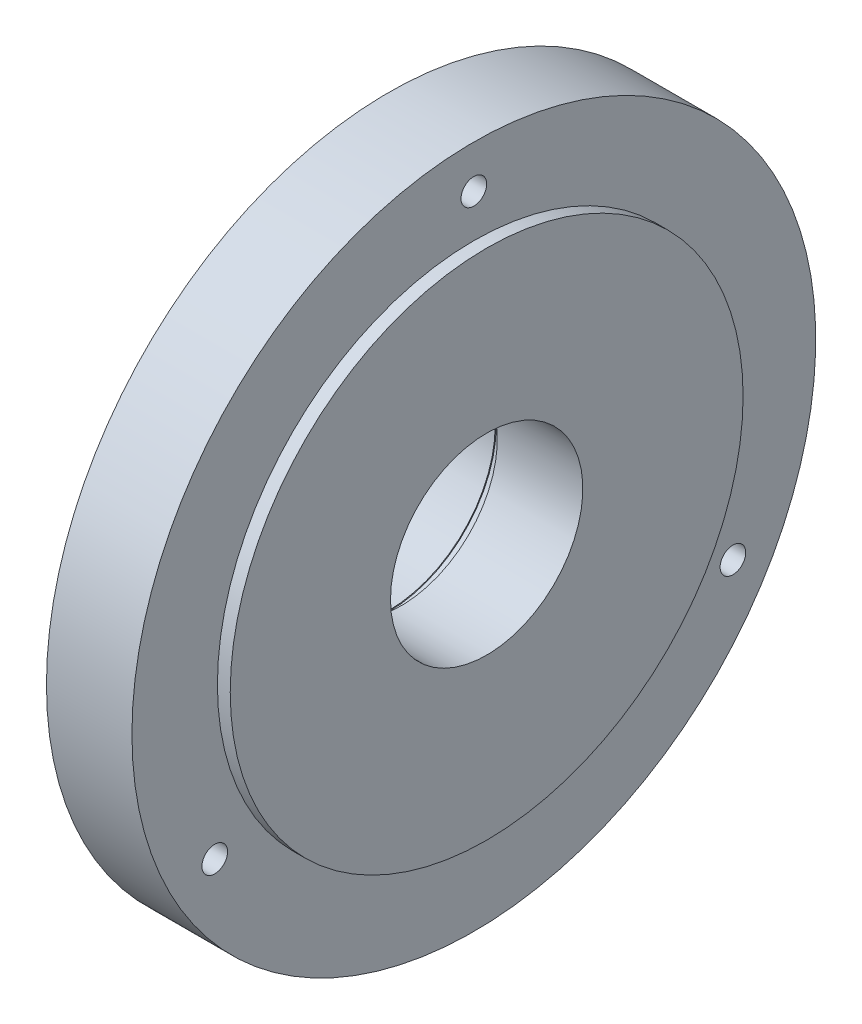
ISO-10303-21;
HEADER;
FILE_DESCRIPTION(('STEP AP214'),'2;1');
FILE_NAME('part.step','',(''),(''),'','','');
FILE_SCHEMA(('AUTOMOTIVE_DESIGN { 1 0 10303 214 1 1 1 1 }'));
ENDSEC;
DATA;
#1=APPLICATION_CONTEXT('core data for automotive mechanical design processes');
#2=APPLICATION_PROTOCOL_DEFINITION('international standard','automotive_design',2000,#1);
#3=PRODUCT_CONTEXT('',#1,'mechanical');
#4=PRODUCT('Part','Part','',(#3));
#5=PRODUCT_RELATED_PRODUCT_CATEGORY('part','',(#4));
#6=PRODUCT_DEFINITION_FORMATION('','',#4);
#7=PRODUCT_DEFINITION_CONTEXT('part definition',#1,'design');
#8=PRODUCT_DEFINITION('design','',#6,#7);
#9=PRODUCT_DEFINITION_SHAPE('','',#8);
#10=(LENGTH_UNIT() NAMED_UNIT(*) SI_UNIT(.MILLI.,.METRE.));
#11=(NAMED_UNIT(*) PLANE_ANGLE_UNIT() SI_UNIT($,.RADIAN.));
#12=(NAMED_UNIT(*) SI_UNIT($,.STERADIAN.) SOLID_ANGLE_UNIT());
#13=UNCERTAINTY_MEASURE_WITH_UNIT(LENGTH_MEASURE(1.E-05),#10,'distance_accuracy_value','');
#14=(GEOMETRIC_REPRESENTATION_CONTEXT(3) GLOBAL_UNCERTAINTY_ASSIGNED_CONTEXT((#13)) GLOBAL_UNIT_ASSIGNED_CONTEXT((#10,
#11,#12)) REPRESENTATION_CONTEXT('',''));
#15=CARTESIAN_POINT('',(0.,0.,0.));
#16=DIRECTION('',(0.,0.,1.));
#17=DIRECTION('',(1.,0.,0.));
#18=AXIS2_PLACEMENT_3D('',#15,#16,#17);
#19=CARTESIAN_POINT('',(0.,60.,0.));
#20=DIRECTION('',(-1.,0.,0.));
#21=DIRECTION('',(0.,0.,1.));
#22=AXIS2_PLACEMENT_3D('',#19,#20,#21);
#23=PLANE('',#22);
#24=CARTESIAN_POINT('',(0.,0.,0.));
#25=DIRECTION('',(-1.,0.,0.));
#26=DIRECTION('',(0.,0.,1.));
#27=AXIS2_PLACEMENT_3D('',#24,#25,#26);
#28=CIRCLE('',#27,60.);
#29=CARTESIAN_POINT('',(0.,0.,60.));
#30=VERTEX_POINT('',#29);
#31=EDGE_CURVE('E82',#30,#30,#28,.T.);
#32=ORIENTED_EDGE('',*,*,#31,.F.);
#33=EDGE_LOOP('',(#32));
#34=FACE_BOUND('',#33,.T.);
#35=CARTESIAN_POINT('',(0.,0.,0.));
#36=DIRECTION('',(-1.,0.,0.));
#37=DIRECTION('',(0.,0.,1.));
#38=AXIS2_PLACEMENT_3D('',#35,#36,#37);
#39=CIRCLE('',#38,22.5);
#40=CARTESIAN_POINT('',(0.,0.,22.5));
#41=VERTEX_POINT('',#40);
#42=EDGE_CURVE('E43',#41,#41,#39,.T.);
#43=ORIENTED_EDGE('',*,*,#42,.T.);
#44=EDGE_LOOP('',(#43));
#45=FACE_BOUND('',#44,.T.);
#46=ADVANCED_FACE('F32',(#34,#45),#23,.F.);
#47=CARTESIAN_POINT('',(-1000.,0.,0.));
#48=DIRECTION('',(-1.,0.,0.));
#49=DIRECTION('',(0.,0.,1.));
#50=AXIS2_PLACEMENT_3D('',#47,#48,#49);
#51=CYLINDRICAL_SURFACE('',#50,22.5);
#52=ORIENTED_EDGE('',*,*,#42,.F.);
#53=EDGE_LOOP('',(#52));
#54=FACE_BOUND('',#53,.T.);
#55=CARTESIAN_POINT('',(-20.,0.,0.));
#56=DIRECTION('',(-1.,0.,0.));
#57=DIRECTION('',(0.,0.,1.));
#58=AXIS2_PLACEMENT_3D('',#55,#56,#57);
#59=CIRCLE('',#58,22.5);
#60=CARTESIAN_POINT('',(-20.,0.,22.5));
#61=VERTEX_POINT('',#60);
#62=EDGE_CURVE('E47',#61,#61,#59,.T.);
#63=ORIENTED_EDGE('',*,*,#62,.T.);
#64=EDGE_LOOP('',(#63));
#65=FACE_BOUND('',#64,.T.);
#66=ADVANCED_FACE('F128',(#54,#65),#51,.F.);
#67=CARTESIAN_POINT('',(-20.,22.5,0.));
#68=DIRECTION('',(1.,0.,0.));
#69=DIRECTION('',(0.,0.,-1.));
#70=AXIS2_PLACEMENT_3D('',#67,#68,#69);
#71=PLANE('',#70);
#72=ORIENTED_EDGE('',*,*,#62,.F.);
#73=EDGE_LOOP('',(#72));
#74=FACE_BOUND('',#73,.T.);
#75=CARTESIAN_POINT('',(-20.,0.,0.));
#76=DIRECTION('',(-1.,0.,0.));
#77=DIRECTION('',(0.,0.,1.));
#78=AXIS2_PLACEMENT_3D('',#75,#76,#77);
#79=CIRCLE('',#78,25.25);
#80=CARTESIAN_POINT('',(-20.,0.,25.25));
#81=VERTEX_POINT('',#80);
#82=EDGE_CURVE('E52',#81,#81,#79,.T.);
#83=ORIENTED_EDGE('',*,*,#82,.T.);
#84=EDGE_LOOP('',(#83));
#85=FACE_BOUND('',#84,.T.);
#86=ADVANCED_FACE('F133',(#74,#85),#71,.F.);
#87=CARTESIAN_POINT('',(-1000.,0.,0.));
#88=DIRECTION('',(-1.,0.,0.));
#89=DIRECTION('',(0.,0.,1.));
#90=AXIS2_PLACEMENT_3D('',#87,#88,#89);
#91=CYLINDRICAL_SURFACE('',#90,25.25);
#92=ORIENTED_EDGE('',*,*,#82,.F.);
#93=EDGE_LOOP('',(#92));
#94=FACE_BOUND('',#93,.T.);
#95=CARTESIAN_POINT('',(-23.,0.,0.));
#96=DIRECTION('',(-1.,0.,0.));
#97=DIRECTION('',(0.,0.,1.));
#98=AXIS2_PLACEMENT_3D('',#95,#96,#97);
#99=CIRCLE('',#98,25.25);
#100=CARTESIAN_POINT('',(-23.,0.,25.25));
#101=VERTEX_POINT('',#100);
#102=EDGE_CURVE('E55',#101,#101,#99,.T.);
#103=ORIENTED_EDGE('',*,*,#102,.T.);
#104=EDGE_LOOP('',(#103));
#105=FACE_BOUND('',#104,.T.);
#106=ADVANCED_FACE('F139',(#94,#105),#91,.F.);
#107=CARTESIAN_POINT('',(-23.,25.25,0.));
#108=DIRECTION('',(-1.,0.,0.));
#109=DIRECTION('',(0.,0.,1.));
#110=AXIS2_PLACEMENT_3D('',#107,#108,#109);
#111=PLANE('',#110);
#112=ORIENTED_EDGE('',*,*,#102,.F.);
#113=EDGE_LOOP('',(#112));
#114=FACE_BOUND('',#113,.T.);
#115=CARTESIAN_POINT('',(-23.,0.,0.));
#116=DIRECTION('',(-1.,0.,0.));
#117=DIRECTION('',(0.,0.,1.));
#118=AXIS2_PLACEMENT_3D('',#115,#116,#117);
#119=CIRCLE('',#118,25.);
#120=CARTESIAN_POINT('',(-23.,0.,25.));
#121=VERTEX_POINT('',#120);
#122=EDGE_CURVE('E58',#121,#121,#119,.T.);
#123=ORIENTED_EDGE('',*,*,#122,.T.);
#124=EDGE_LOOP('',(#123));
#125=FACE_BOUND('',#124,.T.);
#126=ADVANCED_FACE('F145',(#114,#125),#111,.F.);
#127=CARTESIAN_POINT('',(-1000.,0.,0.));
#128=DIRECTION('',(-1.,0.,0.));
#129=DIRECTION('',(0.,0.,1.));
#130=AXIS2_PLACEMENT_3D('',#127,#128,#129);
#131=CYLINDRICAL_SURFACE('',#130,25.);
#132=ORIENTED_EDGE('',*,*,#122,.F.);
#133=EDGE_LOOP('',(#132));
#134=FACE_BOUND('',#133,.T.);
#135=CARTESIAN_POINT('',(-47.,0.,0.));
#136=DIRECTION('',(-1.,0.,0.));
#137=DIRECTION('',(0.,0.,1.));
#138=AXIS2_PLACEMENT_3D('',#135,#136,#137);
#139=CIRCLE('',#138,25.);
#140=CARTESIAN_POINT('',(-47.,0.,25.));
#141=VERTEX_POINT('',#140);
#142=EDGE_CURVE('E61',#141,#141,#139,.T.);
#143=ORIENTED_EDGE('',*,*,#142,.T.);
#144=EDGE_LOOP('',(#143));
#145=FACE_BOUND('',#144,.T.);
#146=ADVANCED_FACE('F151',(#134,#145),#131,.F.);
#147=CARTESIAN_POINT('',(-47.,25.,0.));
#148=DIRECTION('',(1.,0.,0.));
#149=DIRECTION('',(0.,0.,-1.));
#150=AXIS2_PLACEMENT_3D('',#147,#148,#149);
#151=PLANE('',#150);
#152=ORIENTED_EDGE('',*,*,#142,.F.);
#153=EDGE_LOOP('',(#152));
#154=FACE_BOUND('',#153,.T.);
#155=CARTESIAN_POINT('',(-47.,0.,0.));
#156=DIRECTION('',(-1.,0.,0.));
#157=DIRECTION('',(0.,0.,1.));
#158=AXIS2_PLACEMENT_3D('',#155,#156,#157);
#159=CIRCLE('',#158,25.25);
#160=CARTESIAN_POINT('',(-47.,0.,25.25));
#161=VERTEX_POINT('',#160);
#162=EDGE_CURVE('E64',#161,#161,#159,.T.);
#163=ORIENTED_EDGE('',*,*,#162,.T.);
#164=EDGE_LOOP('',(#163));
#165=FACE_BOUND('',#164,.T.);
#166=ADVANCED_FACE('F157',(#154,#165),#151,.F.);
#167=CARTESIAN_POINT('',(-1000.,0.,0.));
#168=DIRECTION('',(-1.,0.,0.));
#169=DIRECTION('',(0.,0.,1.));
#170=AXIS2_PLACEMENT_3D('',#167,#168,#169);
#171=CYLINDRICAL_SURFACE('',#170,25.25);
#172=ORIENTED_EDGE('',*,*,#162,.F.);
#173=EDGE_LOOP('',(#172));
#174=FACE_BOUND('',#173,.T.);
#175=CARTESIAN_POINT('',(-53.,0.,0.));
#176=DIRECTION('',(-1.,0.,0.));
#177=DIRECTION('',(0.,0.,1.));
#178=AXIS2_PLACEMENT_3D('',#175,#176,#177);
#179=CIRCLE('',#178,25.25);
#180=CARTESIAN_POINT('',(-53.,0.,25.25));
#181=VERTEX_POINT('',#180);
#182=EDGE_CURVE('E67',#181,#181,#179,.T.);
#183=ORIENTED_EDGE('',*,*,#182,.T.);
#184=EDGE_LOOP('',(#183));
#185=FACE_BOUND('',#184,.T.);
#186=ADVANCED_FACE('F163',(#174,#185),#171,.F.);
#187=CARTESIAN_POINT('',(-53.,25.25,0.));
#188=DIRECTION('',(1.,0.,0.));
#189=DIRECTION('',(0.,0.,-1.));
#190=AXIS2_PLACEMENT_3D('',#187,#188,#189);
#191=PLANE('',#190);
#192=ORIENTED_EDGE('',*,*,#182,.F.);
#193=EDGE_LOOP('',(#192));
#194=FACE_BOUND('',#193,.T.);
#195=CARTESIAN_POINT('',(-53.,0.,0.));
#196=DIRECTION('',(-1.,0.,0.));
#197=DIRECTION('',(0.,0.,1.));
#198=AXIS2_PLACEMENT_3D('',#195,#196,#197);
#199=CIRCLE('',#198,37.5);
#200=CARTESIAN_POINT('',(-53.,0.,37.5));
#201=VERTEX_POINT('',#200);
#202=EDGE_CURVE('E70',#201,#201,#199,.T.);
#203=ORIENTED_EDGE('',*,*,#202,.T.);
#204=EDGE_LOOP('',(#203));
#205=FACE_BOUND('',#204,.T.);
#206=ADVANCED_FACE('F169',(#194,#205),#191,.F.);
#207=CARTESIAN_POINT('',(-1000.,0.,0.));
#208=DIRECTION('',(-1.,0.,0.));
#209=DIRECTION('',(0.,0.,1.));
#210=AXIS2_PLACEMENT_3D('',#207,#208,#209);
#211=CYLINDRICAL_SURFACE('',#210,37.5);
#212=CARTESIAN_POINT('',(-29.,0.,0.));
#213=DIRECTION('',(1.,0.,0.));
#214=DIRECTION('',(0.,0.,-1.));
#215=AXIS2_PLACEMENT_3D('',#212,#213,#214);
#216=CIRCLE('',#215,37.5);
#217=CARTESIAN_POINT('',(-29.,0.,-37.5));
#218=VERTEX_POINT('',#217);
#219=EDGE_CURVE('E39',#218,#218,#216,.F.);
#220=ORIENTED_EDGE('',*,*,#219,.T.);
#221=EDGE_LOOP('',(#220));
#222=FACE_BOUND('',#221,.T.);
#223=ORIENTED_EDGE('',*,*,#202,.F.);
#224=EDGE_LOOP('',(#223));
#225=FACE_BOUND('',#224,.T.);
#226=ADVANCED_FACE('F175',(#222,#225),#211,.T.);
#227=CARTESIAN_POINT('',(-23.,37.5,0.));
#228=DIRECTION('',(1.,0.,0.));
#229=DIRECTION('',(0.,0.,-1.));
#230=AXIS2_PLACEMENT_3D('',#227,#228,#229);
#231=PLANE('',#230);
#232=CARTESIAN_POINT('',(-23.,-34.9999999999974,-60.6217782649152));
#233=DIRECTION('',(1.,0.,0.));
#234=DIRECTION('',(0.,0.,-1.));
#235=AXIS2_PLACEMENT_3D('',#232,#233,#234);
#236=CIRCLE('',#235,3.0000000000039);
#237=CARTESIAN_POINT('',(-23.,-34.9999999999974,-63.6217782649191));
#238=VERTEX_POINT('',#237);
#239=EDGE_CURVE('E91',#238,#238,#236,.T.);
#240=ORIENTED_EDGE('',*,*,#239,.T.);
#241=EDGE_LOOP('',(#240));
#242=FACE_BOUND('',#241,.T.);
#243=CARTESIAN_POINT('',(-23.,-35.0000000000026,60.6217782649063));
#244=DIRECTION('',(1.,0.,0.));
#245=DIRECTION('',(0.,0.,-1.));
#246=AXIS2_PLACEMENT_3D('',#243,#244,#245);
#247=CIRCLE('',#246,3.00000000000567);
#248=CARTESIAN_POINT('',(-23.,-35.0000000000026,57.6217782649006));
#249=VERTEX_POINT('',#248);
#250=EDGE_CURVE('E94',#249,#249,#247,.T.);
#251=ORIENTED_EDGE('',*,*,#250,.T.);
#252=EDGE_LOOP('',(#251));
#253=FACE_BOUND('',#252,.T.);
#254=CARTESIAN_POINT('',(-23.,70.,0.));
#255=DIRECTION('',(1.,0.,0.));
#256=DIRECTION('',(0.,0.,-1.));
#257=AXIS2_PLACEMENT_3D('',#254,#255,#256);
#258=CIRCLE('',#257,3.);
#259=CARTESIAN_POINT('',(-23.,70.,-3.));
#260=VERTEX_POINT('',#259);
#261=EDGE_CURVE('E85',#260,#260,#258,.T.);
#262=ORIENTED_EDGE('',*,*,#261,.T.);
#263=EDGE_LOOP('',(#262));
#264=FACE_BOUND('',#263,.T.);
#265=CARTESIAN_POINT('',(-23.,0.,0.));
#266=DIRECTION('',(1.,0.,0.));
#267=DIRECTION('',(0.,0.,-1.));
#268=AXIS2_PLACEMENT_3D('',#265,#266,#267);
#269=CIRCLE('',#268,43.5);
#270=CARTESIAN_POINT('',(-23.,0.,-43.5));
#271=VERTEX_POINT('',#270);
#272=EDGE_CURVE('E10',#271,#271,#269,.T.);
#273=ORIENTED_EDGE('',*,*,#272,.T.);
#274=EDGE_LOOP('',(#273));
#275=FACE_BOUND('',#274,.T.);
#276=CARTESIAN_POINT('',(-23.,0.,0.));
#277=DIRECTION('',(-1.,0.,0.));
#278=DIRECTION('',(0.,0.,1.));
#279=AXIS2_PLACEMENT_3D('',#276,#277,#278);
#280=CIRCLE('',#279,80.);
#281=CARTESIAN_POINT('',(-23.,0.,80.));
#282=VERTEX_POINT('',#281);
#283=EDGE_CURVE('E73',#282,#282,#280,.T.);
#284=ORIENTED_EDGE('',*,*,#283,.T.);
#285=EDGE_LOOP('',(#284));
#286=FACE_BOUND('',#285,.T.);
#287=ADVANCED_FACE('F180',(#242,#253,#264,#275,#286),#231,.F.);
#288=CARTESIAN_POINT('',(-1000.,0.,0.));
#289=DIRECTION('',(-1.,0.,0.));
#290=DIRECTION('',(0.,0.,1.));
#291=AXIS2_PLACEMENT_3D('',#288,#289,#290);
#292=CYLINDRICAL_SURFACE('',#291,80.);
#293=ORIENTED_EDGE('',*,*,#283,.F.);
#294=EDGE_LOOP('',(#293));
#295=FACE_BOUND('',#294,.T.);
#296=CARTESIAN_POINT('',(-3.,0.,0.));
#297=DIRECTION('',(-1.,0.,0.));
#298=DIRECTION('',(0.,0.,1.));
#299=AXIS2_PLACEMENT_3D('',#296,#297,#298);
#300=CIRCLE('',#299,80.);
#301=CARTESIAN_POINT('',(-3.,0.,80.));
#302=VERTEX_POINT('',#301);
#303=EDGE_CURVE('E76',#302,#302,#300,.T.);
#304=ORIENTED_EDGE('',*,*,#303,.T.);
#305=EDGE_LOOP('',(#304));
#306=FACE_BOUND('',#305,.T.);
#307=ADVANCED_FACE('F111',(#295,#306),#292,.T.);
#308=CARTESIAN_POINT('',(-3.,80.,0.));
#309=DIRECTION('',(-1.,0.,0.));
#310=DIRECTION('',(0.,0.,1.));
#311=AXIS2_PLACEMENT_3D('',#308,#309,#310);
#312=PLANE('',#311);
#313=CARTESIAN_POINT('',(-3.,-34.9999999999974,-60.6217782649152));
#314=DIRECTION('',(1.,0.,0.));
#315=DIRECTION('',(0.,0.,-1.));
#316=AXIS2_PLACEMENT_3D('',#313,#314,#315);
#317=CIRCLE('',#316,3.0000000000039);
#318=CARTESIAN_POINT('',(-3.,-34.9999999999974,-63.6217782649191));
#319=VERTEX_POINT('',#318);
#320=EDGE_CURVE('E97',#319,#319,#317,.T.);
#321=ORIENTED_EDGE('',*,*,#320,.F.);
#322=EDGE_LOOP('',(#321));
#323=FACE_BOUND('',#322,.T.);
#324=CARTESIAN_POINT('',(-3.,-35.0000000000026,60.6217782649063));
#325=DIRECTION('',(1.,0.,0.));
#326=DIRECTION('',(0.,0.,-1.));
#327=AXIS2_PLACEMENT_3D('',#324,#325,#326);
#328=CIRCLE('',#327,3.00000000000567);
#329=CARTESIAN_POINT('',(-3.,-35.0000000000026,57.6217782649006));
#330=VERTEX_POINT('',#329);
#331=EDGE_CURVE('E98',#330,#330,#328,.T.);
#332=ORIENTED_EDGE('',*,*,#331,.F.);
#333=EDGE_LOOP('',(#332));
#334=FACE_BOUND('',#333,.T.);
#335=CARTESIAN_POINT('',(-3.,70.,0.));
#336=DIRECTION('',(1.,0.,0.));
#337=DIRECTION('',(0.,0.,-1.));
#338=AXIS2_PLACEMENT_3D('',#335,#336,#337);
#339=CIRCLE('',#338,3.);
#340=CARTESIAN_POINT('',(-3.,70.,-3.));
#341=VERTEX_POINT('',#340);
#342=EDGE_CURVE('E88',#341,#341,#339,.T.);
#343=ORIENTED_EDGE('',*,*,#342,.F.);
#344=EDGE_LOOP('',(#343));
#345=FACE_BOUND('',#344,.T.);
#346=ORIENTED_EDGE('',*,*,#303,.F.);
#347=EDGE_LOOP('',(#346));
#348=FACE_BOUND('',#347,.T.);
#349=CARTESIAN_POINT('',(-3.,0.,0.));
#350=DIRECTION('',(-1.,0.,0.));
#351=DIRECTION('',(0.,0.,1.));
#352=AXIS2_PLACEMENT_3D('',#349,#350,#351);
#353=CIRCLE('',#352,60.);
#354=CARTESIAN_POINT('',(-3.,0.,60.));
#355=VERTEX_POINT('',#354);
#356=EDGE_CURVE('E79',#355,#355,#353,.T.);
#357=ORIENTED_EDGE('',*,*,#356,.T.);
#358=EDGE_LOOP('',(#357));
#359=FACE_BOUND('',#358,.T.);
#360=ADVANCED_FACE('F107',(#323,#334,#345,#348,#359),#312,.F.);
#361=CARTESIAN_POINT('',(-1000.,0.,0.));
#362=DIRECTION('',(-1.,0.,0.));
#363=DIRECTION('',(0.,0.,1.));
#364=AXIS2_PLACEMENT_3D('',#361,#362,#363);
#365=CYLINDRICAL_SURFACE('',#364,60.);
#366=ORIENTED_EDGE('',*,*,#356,.F.);
#367=EDGE_LOOP('',(#366));
#368=FACE_BOUND('',#367,.T.);
#369=ORIENTED_EDGE('',*,*,#31,.T.);
#370=EDGE_LOOP('',(#369));
#371=FACE_BOUND('',#370,.T.);
#372=ADVANCED_FACE('F110',(#368,#371),#365,.T.);
#373=CARTESIAN_POINT('',(-29.,0.,0.));
#374=DIRECTION('',(1.,0.,0.));
#375=DIRECTION('',(0.,0.,-1.));
#376=AXIS2_PLACEMENT_3D('',#373,#374,#375);
#377=TOROIDAL_SURFACE('',#376,43.5,6.);
#378=ORIENTED_EDGE('',*,*,#272,.F.);
#379=EDGE_LOOP('',(#378));
#380=FACE_BOUND('',#379,.T.);
#381=ORIENTED_EDGE('',*,*,#219,.F.);
#382=EDGE_LOOP('',(#381));
#383=FACE_BOUND('',#382,.T.);
#384=ADVANCED_FACE('F34',(#380,#383),#377,.F.);
#385=CARTESIAN_POINT('',(-53.,70.,0.));
#386=DIRECTION('',(1.,0.,0.));
#387=DIRECTION('',(0.,0.,-1.));
#388=AXIS2_PLACEMENT_3D('',#385,#386,#387);
#389=CYLINDRICAL_SURFACE('',#388,3.);
#390=ORIENTED_EDGE('',*,*,#342,.T.);
#391=EDGE_LOOP('',(#390));
#392=FACE_BOUND('',#391,.T.);
#393=ORIENTED_EDGE('',*,*,#261,.F.);
#394=EDGE_LOOP('',(#393));
#395=FACE_BOUND('',#394,.T.);
#396=ADVANCED_FACE('F191',(#392,#395),#389,.F.);
#397=CARTESIAN_POINT('',(-53.,-35.0000000000026,60.6217782649063));
#398=DIRECTION('',(1.,0.,0.));
#399=DIRECTION('',(0.,0.,-1.));
#400=AXIS2_PLACEMENT_3D('',#397,#398,#399);
#401=CYLINDRICAL_SURFACE('',#400,3.00000000000567);
#402=ORIENTED_EDGE('',*,*,#331,.T.);
#403=EDGE_LOOP('',(#402));
#404=FACE_BOUND('',#403,.T.);
#405=ORIENTED_EDGE('',*,*,#250,.F.);
#406=EDGE_LOOP('',(#405));
#407=FACE_BOUND('',#406,.T.);
#408=ADVANCED_FACE('F194',(#404,#407),#401,.F.);
#409=CARTESIAN_POINT('',(-53.,-34.9999999999974,-60.6217782649152));
#410=DIRECTION('',(1.,0.,0.));
#411=DIRECTION('',(0.,0.,-1.));
#412=AXIS2_PLACEMENT_3D('',#409,#410,#411);
#413=CYLINDRICAL_SURFACE('',#412,3.0000000000039);
#414=ORIENTED_EDGE('',*,*,#320,.T.);
#415=EDGE_LOOP('',(#414));
#416=FACE_BOUND('',#415,.T.);
#417=ORIENTED_EDGE('',*,*,#239,.F.);
#418=EDGE_LOOP('',(#417));
#419=FACE_BOUND('',#418,.T.);
#420=ADVANCED_FACE('F104',(#416,#419),#413,.F.);
#421=CLOSED_SHELL('',(#46,#66,#86,#106,#126,#146,#166,#186,#206,#226,#287,#307,#360,#372,#384,
#396,#408,#420));
#422=MANIFOLD_SOLID_BREP('B2',#421);
#423=ADVANCED_BREP_SHAPE_REPRESENTATION('',(#18,#422),#14);
#424=SHAPE_DEFINITION_REPRESENTATION(#9,#423);
ENDSEC;
END-ISO-10303-21;
